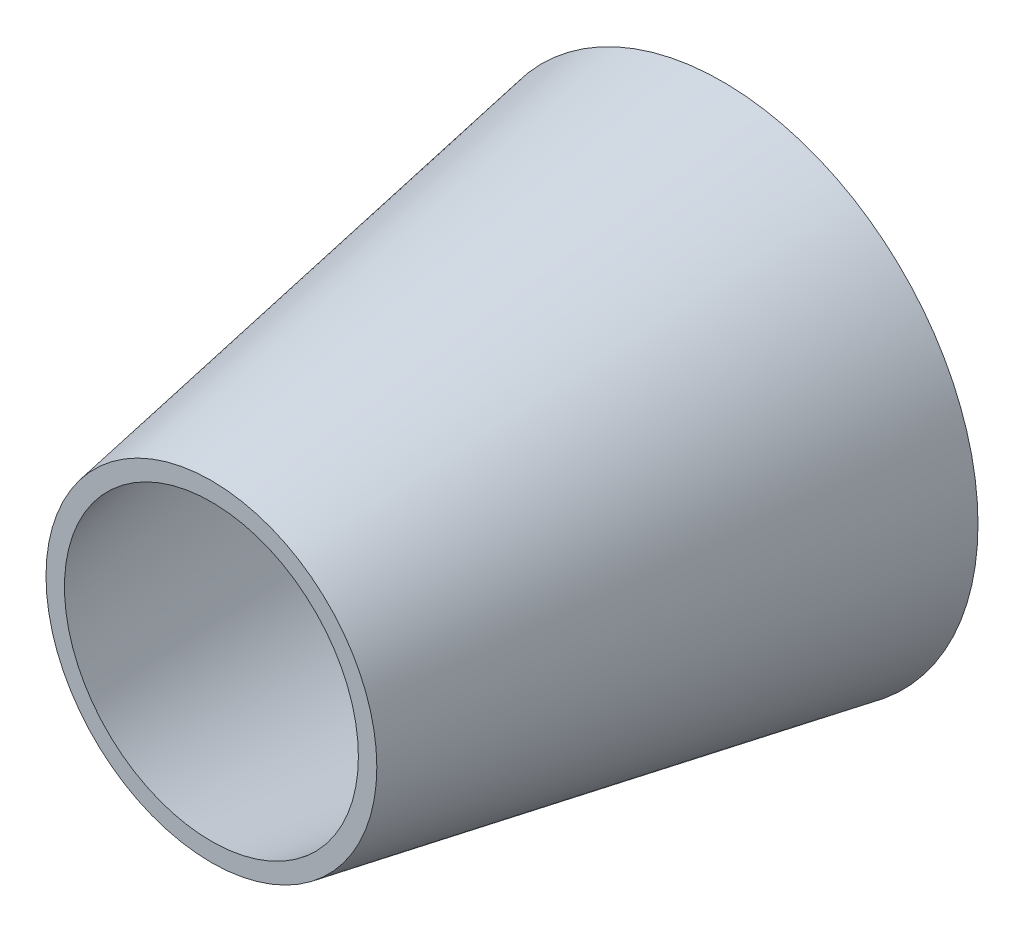
ISO-10303-21;
HEADER;
FILE_DESCRIPTION(('STEP AP214'),'2;1');
FILE_NAME('part.step','',(''),(''),'','','');
FILE_SCHEMA(('AUTOMOTIVE_DESIGN { 1 0 10303 214 1 1 1 1 }'));
ENDSEC;
DATA;
#1=APPLICATION_CONTEXT('core data for automotive mechanical design processes');
#2=APPLICATION_PROTOCOL_DEFINITION('international standard','automotive_design',2000,#1);
#3=PRODUCT_CONTEXT('',#1,'mechanical');
#4=PRODUCT('Part','Part','',(#3));
#5=PRODUCT_RELATED_PRODUCT_CATEGORY('part','',(#4));
#6=PRODUCT_DEFINITION_FORMATION('','',#4);
#7=PRODUCT_DEFINITION_CONTEXT('part definition',#1,'design');
#8=PRODUCT_DEFINITION('design','',#6,#7);
#9=PRODUCT_DEFINITION_SHAPE('','',#8);
#10=(LENGTH_UNIT() NAMED_UNIT(*) SI_UNIT(.MILLI.,.METRE.));
#11=(NAMED_UNIT(*) PLANE_ANGLE_UNIT() SI_UNIT($,.RADIAN.));
#12=(NAMED_UNIT(*) SI_UNIT($,.STERADIAN.) SOLID_ANGLE_UNIT());
#13=UNCERTAINTY_MEASURE_WITH_UNIT(LENGTH_MEASURE(1.E-05),#10,'distance_accuracy_value','');
#14=(GEOMETRIC_REPRESENTATION_CONTEXT(3) GLOBAL_UNCERTAINTY_ASSIGNED_CONTEXT((#13)) GLOBAL_UNIT_ASSIGNED_CONTEXT((#10,
#11,#12)) REPRESENTATION_CONTEXT('',''));
#15=CARTESIAN_POINT('',(0.,0.,0.));
#16=DIRECTION('',(0.,0.,1.));
#17=DIRECTION('',(1.,0.,0.));
#18=AXIS2_PLACEMENT_3D('',#15,#16,#17);
#19=CARTESIAN_POINT('',(0.,0.,0.));
#20=DIRECTION('',(0.,0.,-1.));
#21=DIRECTION('',(1.,0.,0.));
#22=AXIS2_PLACEMENT_3D('',#19,#20,#21);
#23=CONICAL_SURFACE('',#22,15.,0.174532925199433);
#24=CARTESIAN_POINT('',(0.,0.,30.));
#25=DIRECTION('',(0.,0.,1.));
#26=DIRECTION('',(1.,0.,0.));
#27=AXIS2_PLACEMENT_3D('',#24,#25,#26);
#28=CIRCLE('',#27,9.71019057874605);
#29=CARTESIAN_POINT('',(9.71019057874605,0.,30.));
#30=VERTEX_POINT('',#29);
#31=EDGE_CURVE('E10',#30,#30,#28,.T.);
#32=ORIENTED_EDGE('',*,*,#31,.F.);
#33=EDGE_LOOP('',(#32));
#34=FACE_BOUND('',#33,.T.);
#35=CARTESIAN_POINT('',(0.,0.,0.));
#36=DIRECTION('',(0.,0.,1.));
#37=DIRECTION('',(1.,0.,0.));
#38=AXIS2_PLACEMENT_3D('',#35,#36,#37);
#39=CIRCLE('',#38,15.);
#40=CARTESIAN_POINT('',(15.,0.,0.));
#41=VERTEX_POINT('',#40);
#42=EDGE_CURVE('E43',#41,#41,#39,.T.);
#43=ORIENTED_EDGE('',*,*,#42,.T.);
#44=EDGE_LOOP('',(#43));
#45=FACE_BOUND('',#44,.T.);
#46=ADVANCED_FACE('F36',(#34,#45),#23,.T.);
#47=CARTESIAN_POINT('',(0.,0.,30.));
#48=DIRECTION('',(0.,0.,1.));
#49=DIRECTION('',(1.,0.,0.));
#50=AXIS2_PLACEMENT_3D('',#47,#48,#49);
#51=PLANE('',#50);
#52=CARTESIAN_POINT('',(0.,0.,30.));
#53=DIRECTION('',(0.,0.,1.));
#54=DIRECTION('',(1.,0.,0.));
#55=AXIS2_PLACEMENT_3D('',#52,#53,#54);
#56=CIRCLE('',#55,8.62816590113063);
#57=CARTESIAN_POINT('',(8.62816590113063,0.,30.));
#58=VERTEX_POINT('',#57);
#59=EDGE_CURVE('E53',#58,#58,#56,.T.);
#60=ORIENTED_EDGE('',*,*,#59,.F.);
#61=EDGE_LOOP('',(#60));
#62=FACE_BOUND('',#61,.T.);
#63=ORIENTED_EDGE('',*,*,#31,.T.);
#64=EDGE_LOOP('',(#63));
#65=FACE_BOUND('',#64,.T.);
#66=ADVANCED_FACE('F62',(#62,#65),#51,.T.);
#67=CARTESIAN_POINT('',(0.,0.,0.));
#68=DIRECTION('',(0.,0.,1.));
#69=DIRECTION('',(1.,0.,0.));
#70=AXIS2_PLACEMENT_3D('',#67,#68,#69);
#71=PLANE('',#70);
#72=CARTESIAN_POINT('',(0.,0.,0.));
#73=DIRECTION('',(0.,0.,1.));
#74=DIRECTION('',(1.,0.,0.));
#75=AXIS2_PLACEMENT_3D('',#72,#73,#74);
#76=CIRCLE('',#75,13.3796991108667);
#77=CARTESIAN_POINT('',(13.3796991108667,0.,0.));
#78=VERTEX_POINT('',#77);
#79=EDGE_CURVE('E48',#78,#78,#76,.T.);
#80=ORIENTED_EDGE('',*,*,#79,.T.);
#81=EDGE_LOOP('',(#80));
#82=FACE_BOUND('',#81,.T.);
#83=ORIENTED_EDGE('',*,*,#42,.F.);
#84=EDGE_LOOP('',(#83));
#85=FACE_BOUND('',#84,.T.);
#86=ADVANCED_FACE('F64',(#82,#85),#71,.F.);
#87=CARTESIAN_POINT('',(0.,0.,30.));
#88=DIRECTION('',(0.,0.,-1.));
#89=DIRECTION('',(1.,0.,0.));
#90=AXIS2_PLACEMENT_3D('',#87,#88,#89);
#91=CONICAL_SURFACE('',#90,8.62816590113063,0.15707963267949);
#92=ORIENTED_EDGE('',*,*,#79,.F.);
#93=EDGE_LOOP('',(#92));
#94=FACE_BOUND('',#93,.T.);
#95=ORIENTED_EDGE('',*,*,#59,.T.);
#96=EDGE_LOOP('',(#95));
#97=FACE_BOUND('',#96,.T.);
#98=ADVANCED_FACE('F60',(#94,#97),#91,.F.);
#99=CLOSED_SHELL('',(#46,#66,#86,#98));
#100=MANIFOLD_SOLID_BREP('B2',#99);
#101=ADVANCED_BREP_SHAPE_REPRESENTATION('',(#18,#100),#14);
#102=SHAPE_DEFINITION_REPRESENTATION(#9,#101);
ENDSEC;
END-ISO-10303-21;
